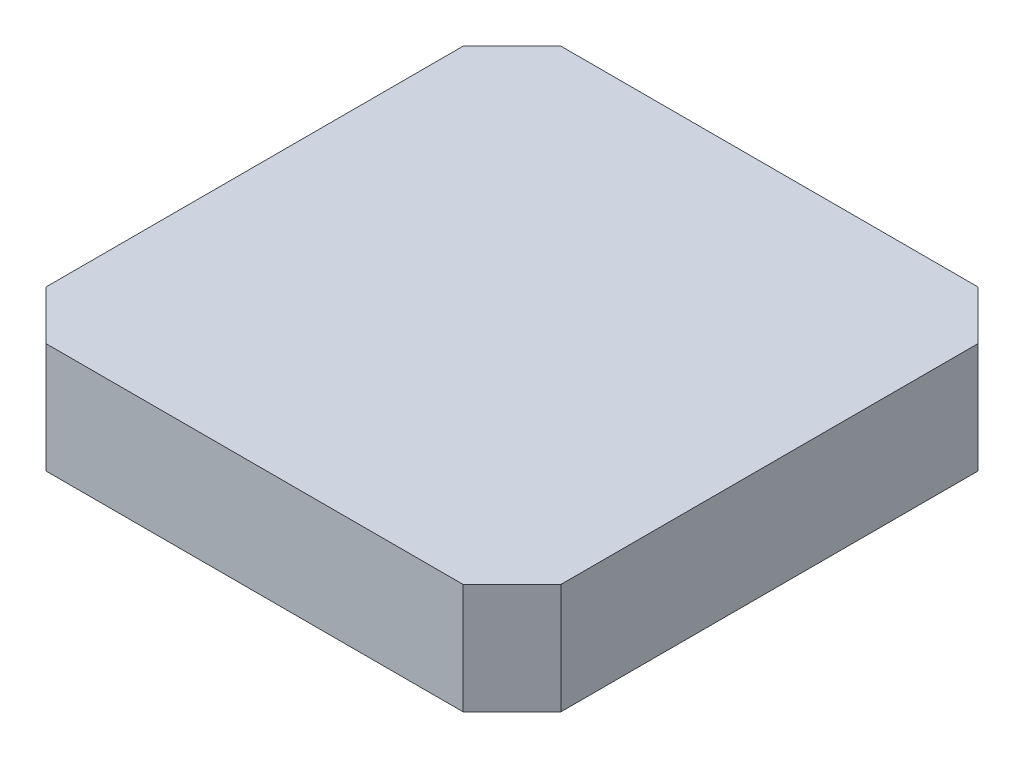
ISO-10303-21;
HEADER;
FILE_DESCRIPTION(('STEP AP214'),'2;1');
FILE_NAME('part.step','',(''),(''),'','','');
FILE_SCHEMA(('AUTOMOTIVE_DESIGN { 1 0 10303 214 1 1 1 1 }'));
ENDSEC;
DATA;
#1=APPLICATION_CONTEXT('core data for automotive mechanical design processes');
#2=APPLICATION_PROTOCOL_DEFINITION('international standard','automotive_design',2000,#1);
#3=PRODUCT_CONTEXT('',#1,'mechanical');
#4=PRODUCT('Part','Part','',(#3));
#5=PRODUCT_RELATED_PRODUCT_CATEGORY('part','',(#4));
#6=PRODUCT_DEFINITION_FORMATION('','',#4);
#7=PRODUCT_DEFINITION_CONTEXT('part definition',#1,'design');
#8=PRODUCT_DEFINITION('design','',#6,#7);
#9=PRODUCT_DEFINITION_SHAPE('','',#8);
#10=(LENGTH_UNIT() NAMED_UNIT(*) SI_UNIT(.MILLI.,.METRE.));
#11=(NAMED_UNIT(*) PLANE_ANGLE_UNIT() SI_UNIT($,.RADIAN.));
#12=(NAMED_UNIT(*) SI_UNIT($,.STERADIAN.) SOLID_ANGLE_UNIT());
#13=UNCERTAINTY_MEASURE_WITH_UNIT(LENGTH_MEASURE(1.E-05),#10,'distance_accuracy_value','');
#14=(GEOMETRIC_REPRESENTATION_CONTEXT(3) GLOBAL_UNCERTAINTY_ASSIGNED_CONTEXT((#13)) GLOBAL_UNIT_ASSIGNED_CONTEXT((#10,
#11,#12)) REPRESENTATION_CONTEXT('',''));
#15=CARTESIAN_POINT('',(0.,0.,0.));
#16=DIRECTION('',(0.,0.,1.));
#17=DIRECTION('',(1.,0.,0.));
#18=AXIS2_PLACEMENT_3D('',#15,#16,#17);
#19=CARTESIAN_POINT('',(-21.,9.,-21.));
#20=DIRECTION('',(1.,0.,0.));
#21=DIRECTION('',(0.,0.,-1.));
#22=AXIS2_PLACEMENT_3D('',#19,#20,#21);
#23=PLANE('',#22);
#24=DIRECTION('',(0.,0.,1.));
#25=VECTOR('',#24,1.);
#26=CARTESIAN_POINT('',(-21.,9.,-21.));
#27=LINE('',#26,#25);
#28=CARTESIAN_POINT('',(-21.,9.,-17.));
#29=VERTEX_POINT('',#28);
#30=CARTESIAN_POINT('',(-21.,9.,17.));
#31=VERTEX_POINT('',#30);
#32=EDGE_CURVE('E127',#29,#31,#27,.T.);
#33=ORIENTED_EDGE('',*,*,#32,.F.);
#34=DIRECTION('',(0.,-1.,0.));
#35=VECTOR('',#34,1.);
#36=CARTESIAN_POINT('',(-21.,9.,-17.));
#37=LINE('',#36,#35);
#38=CARTESIAN_POINT('',(-21.,0.,-17.));
#39=VERTEX_POINT('',#38);
#40=EDGE_CURVE('E11',#29,#39,#37,.T.);
#41=ORIENTED_EDGE('',*,*,#40,.T.);
#42=DIRECTION('',(0.,0.,1.));
#43=VECTOR('',#42,1.);
#44=CARTESIAN_POINT('',(-21.,0.,-21.));
#45=LINE('',#44,#43);
#46=CARTESIAN_POINT('',(-21.,0.,17.));
#47=VERTEX_POINT('',#46);
#48=EDGE_CURVE('E158',#39,#47,#45,.T.);
#49=ORIENTED_EDGE('',*,*,#48,.T.);
#50=DIRECTION('',(0.,1.,0.));
#51=VECTOR('',#50,1.);
#52=CARTESIAN_POINT('',(-21.,9.,17.));
#53=LINE('',#52,#51);
#54=EDGE_CURVE('E41',#47,#31,#53,.T.);
#55=ORIENTED_EDGE('',*,*,#54,.T.);
#56=EDGE_LOOP('',(#33,#41,#49,#55));
#57=FACE_BOUND('',#56,.T.);
#58=ADVANCED_FACE('F33',(#57),#23,.F.);
#59=CARTESIAN_POINT('',(-21.,9.,21.));
#60=DIRECTION('',(0.,0.,-1.));
#61=DIRECTION('',(-1.,0.,0.));
#62=AXIS2_PLACEMENT_3D('',#59,#60,#61);
#63=PLANE('',#62);
#64=DIRECTION('',(1.,0.,0.));
#65=VECTOR('',#64,1.);
#66=CARTESIAN_POINT('',(-21.,0.,21.));
#67=LINE('',#66,#65);
#68=CARTESIAN_POINT('',(-17.,0.,21.));
#69=VERTEX_POINT('',#68);
#70=CARTESIAN_POINT('',(17.,0.,21.));
#71=VERTEX_POINT('',#70);
#72=EDGE_CURVE('E132',#69,#71,#67,.T.);
#73=ORIENTED_EDGE('',*,*,#72,.T.);
#74=DIRECTION('',(0.,1.,0.));
#75=VECTOR('',#74,1.);
#76=CARTESIAN_POINT('',(17.,9.,21.));
#77=LINE('',#76,#75);
#78=CARTESIAN_POINT('',(17.,9.,21.));
#79=VERTEX_POINT('',#78);
#80=EDGE_CURVE('E48',#71,#79,#77,.T.);
#81=ORIENTED_EDGE('',*,*,#80,.T.);
#82=DIRECTION('',(1.,0.,0.));
#83=VECTOR('',#82,1.);
#84=CARTESIAN_POINT('',(-21.,9.,21.));
#85=LINE('',#84,#83);
#86=CARTESIAN_POINT('',(-17.,9.,21.));
#87=VERTEX_POINT('',#86);
#88=EDGE_CURVE('E130',#87,#79,#85,.T.);
#89=ORIENTED_EDGE('',*,*,#88,.F.);
#90=DIRECTION('',(0.,-1.,0.));
#91=VECTOR('',#90,1.);
#92=CARTESIAN_POINT('',(-17.,9.,21.));
#93=LINE('',#92,#91);
#94=EDGE_CURVE('E150',#87,#69,#93,.T.);
#95=ORIENTED_EDGE('',*,*,#94,.T.);
#96=EDGE_LOOP('',(#73,#81,#89,#95));
#97=FACE_BOUND('',#96,.T.);
#98=ADVANCED_FACE('F165',(#97),#63,.F.);
#99=CARTESIAN_POINT('',(21.,9.,-21.));
#100=DIRECTION('',(-1.,0.,0.));
#101=DIRECTION('',(0.,0.,1.));
#102=AXIS2_PLACEMENT_3D('',#99,#100,#101);
#103=PLANE('',#102);
#104=DIRECTION('',(0.,0.,-1.));
#105=VECTOR('',#104,1.);
#106=CARTESIAN_POINT('',(21.,0.,-21.));
#107=LINE('',#106,#105);
#108=CARTESIAN_POINT('',(21.,0.,17.));
#109=VERTEX_POINT('',#108);
#110=CARTESIAN_POINT('',(21.,0.,-17.));
#111=VERTEX_POINT('',#110);
#112=EDGE_CURVE('E128',#109,#111,#107,.T.);
#113=ORIENTED_EDGE('',*,*,#112,.T.);
#114=DIRECTION('',(0.,1.,0.));
#115=VECTOR('',#114,1.);
#116=CARTESIAN_POINT('',(21.,9.,-17.));
#117=LINE('',#116,#115);
#118=CARTESIAN_POINT('',(21.,9.,-17.));
#119=VERTEX_POINT('',#118);
#120=EDGE_CURVE('E105',#111,#119,#117,.T.);
#121=ORIENTED_EDGE('',*,*,#120,.T.);
#122=DIRECTION('',(0.,0.,-1.));
#123=VECTOR('',#122,1.);
#124=CARTESIAN_POINT('',(21.,9.,-21.));
#125=LINE('',#124,#123);
#126=CARTESIAN_POINT('',(21.,9.,17.));
#127=VERTEX_POINT('',#126);
#128=EDGE_CURVE('E170',#127,#119,#125,.T.);
#129=ORIENTED_EDGE('',*,*,#128,.F.);
#130=DIRECTION('',(0.,-1.,0.));
#131=VECTOR('',#130,1.);
#132=CARTESIAN_POINT('',(21.,9.,17.));
#133=LINE('',#132,#131);
#134=EDGE_CURVE('E110',#127,#109,#133,.T.);
#135=ORIENTED_EDGE('',*,*,#134,.T.);
#136=EDGE_LOOP('',(#113,#121,#129,#135));
#137=FACE_BOUND('',#136,.T.);
#138=ADVANCED_FACE('F196',(#137),#103,.F.);
#139=CARTESIAN_POINT('',(-21.,9.,-21.));
#140=DIRECTION('',(0.,0.,1.));
#141=DIRECTION('',(1.,0.,0.));
#142=AXIS2_PLACEMENT_3D('',#139,#140,#141);
#143=PLANE('',#142);
#144=DIRECTION('',(-1.,0.,0.));
#145=VECTOR('',#144,1.);
#146=CARTESIAN_POINT('',(-21.,9.,-21.));
#147=LINE('',#146,#145);
#148=CARTESIAN_POINT('',(17.,9.,-21.));
#149=VERTEX_POINT('',#148);
#150=CARTESIAN_POINT('',(-17.,9.,-21.));
#151=VERTEX_POINT('',#150);
#152=EDGE_CURVE('E120',#149,#151,#147,.T.);
#153=ORIENTED_EDGE('',*,*,#152,.F.);
#154=DIRECTION('',(0.,-1.,0.));
#155=VECTOR('',#154,1.);
#156=CARTESIAN_POINT('',(17.,9.,-21.));
#157=LINE('',#156,#155);
#158=CARTESIAN_POINT('',(17.,0.,-21.));
#159=VERTEX_POINT('',#158);
#160=EDGE_CURVE('E104',#149,#159,#157,.T.);
#161=ORIENTED_EDGE('',*,*,#160,.T.);
#162=DIRECTION('',(-1.,0.,0.));
#163=VECTOR('',#162,1.);
#164=CARTESIAN_POINT('',(-21.,0.,-21.));
#165=LINE('',#164,#163);
#166=CARTESIAN_POINT('',(-17.,0.,-21.));
#167=VERTEX_POINT('',#166);
#168=EDGE_CURVE('E117',#159,#167,#165,.T.);
#169=ORIENTED_EDGE('',*,*,#168,.T.);
#170=DIRECTION('',(0.,1.,0.));
#171=VECTOR('',#170,1.);
#172=CARTESIAN_POINT('',(-17.,9.,-21.));
#173=LINE('',#172,#171);
#174=EDGE_CURVE('E122',#167,#151,#173,.T.);
#175=ORIENTED_EDGE('',*,*,#174,.T.);
#176=EDGE_LOOP('',(#153,#161,#169,#175));
#177=FACE_BOUND('',#176,.T.);
#178=ADVANCED_FACE('F116',(#177),#143,.F.);
#179=CARTESIAN_POINT('',(-21.,9.,21.));
#180=DIRECTION('',(0.,1.,0.));
#181=DIRECTION('',(0.,0.,1.));
#182=AXIS2_PLACEMENT_3D('',#179,#180,#181);
#183=PLANE('',#182);
#184=ORIENTED_EDGE('',*,*,#128,.T.);
#185=DIRECTION('',(0.707106781186546,0.,0.707106781186549));
#186=VECTOR('',#185,1.);
#187=CARTESIAN_POINT('',(19.0000000000001,9.,-18.9999999999999));
#188=LINE('',#187,#186);
#189=EDGE_CURVE('E148',#119,#149,#188,.F.);
#190=ORIENTED_EDGE('',*,*,#189,.T.);
#191=ORIENTED_EDGE('',*,*,#152,.T.);
#192=DIRECTION('',(0.707106781186549,0.,-0.707106781186546));
#193=VECTOR('',#192,1.);
#194=CARTESIAN_POINT('',(-40.,9.,1.99999999999993));
#195=LINE('',#194,#193);
#196=EDGE_CURVE('E144',#151,#29,#195,.F.);
#197=ORIENTED_EDGE('',*,*,#196,.T.);
#198=ORIENTED_EDGE('',*,*,#32,.T.);
#199=DIRECTION('',(-0.707106781186546,0.,-0.707106781186549));
#200=VECTOR('',#199,1.);
#201=CARTESIAN_POINT('',(-19.,9.,19.));
#202=LINE('',#201,#200);
#203=EDGE_CURVE('E55',#31,#87,#202,.F.);
#204=ORIENTED_EDGE('',*,*,#203,.T.);
#205=ORIENTED_EDGE('',*,*,#88,.T.);
#206=DIRECTION('',(-0.707106781186549,0.,0.707106781186546));
#207=VECTOR('',#206,1.);
#208=CARTESIAN_POINT('',(-2.00000000000007,9.,40.));
#209=LINE('',#208,#207);
#210=EDGE_CURVE('E146',#79,#127,#209,.F.);
#211=ORIENTED_EDGE('',*,*,#210,.T.);
#212=EDGE_LOOP('',(#184,#190,#191,#197,#198,#204,#205,#211));
#213=FACE_BOUND('',#212,.T.);
#214=ADVANCED_FACE('F161',(#213),#183,.T.);
#215=CARTESIAN_POINT('',(-21.,0.,21.));
#216=DIRECTION('',(0.,1.,0.));
#217=DIRECTION('',(0.,0.,1.));
#218=AXIS2_PLACEMENT_3D('',#215,#216,#217);
#219=PLANE('',#218);
#220=CARTESIAN_POINT('',(0.,0.,0.));
#221=DIRECTION('',(0.,-1.,0.));
#222=DIRECTION('',(0.,0.,-1.));
#223=AXIS2_PLACEMENT_3D('',#220,#221,#222);
#224=CIRCLE('',#223,4.);
#225=CARTESIAN_POINT('',(0.,0.,-4.));
#226=VERTEX_POINT('',#225);
#227=EDGE_CURVE('E175',#226,#226,#224,.T.);
#228=ORIENTED_EDGE('',*,*,#227,.F.);
#229=EDGE_LOOP('',(#228));
#230=FACE_BOUND('',#229,.T.);
#231=ORIENTED_EDGE('',*,*,#168,.F.);
#232=DIRECTION('',(-0.707106781186546,0.,-0.707106781186549));
#233=VECTOR('',#232,1.);
#234=CARTESIAN_POINT('',(17.,0.,-21.));
#235=LINE('',#234,#233);
#236=EDGE_CURVE('E100',#159,#111,#235,.F.);
#237=ORIENTED_EDGE('',*,*,#236,.T.);
#238=ORIENTED_EDGE('',*,*,#112,.F.);
#239=DIRECTION('',(0.707106781186549,0.,-0.707106781186546));
#240=VECTOR('',#239,1.);
#241=CARTESIAN_POINT('',(21.,0.,17.));
#242=LINE('',#241,#240);
#243=EDGE_CURVE('E111',#109,#71,#242,.F.);
#244=ORIENTED_EDGE('',*,*,#243,.T.);
#245=ORIENTED_EDGE('',*,*,#72,.F.);
#246=DIRECTION('',(0.707106781186546,0.,0.707106781186549));
#247=VECTOR('',#246,1.);
#248=CARTESIAN_POINT('',(-17.,0.,21.));
#249=LINE('',#248,#247);
#250=EDGE_CURVE('E121',#69,#47,#249,.F.);
#251=ORIENTED_EDGE('',*,*,#250,.T.);
#252=ORIENTED_EDGE('',*,*,#48,.F.);
#253=DIRECTION('',(-0.707106781186549,0.,0.707106781186546));
#254=VECTOR('',#253,1.);
#255=CARTESIAN_POINT('',(-21.,0.,-17.));
#256=LINE('',#255,#254);
#257=EDGE_CURVE('E126',#39,#167,#256,.F.);
#258=ORIENTED_EDGE('',*,*,#257,.T.);
#259=EDGE_LOOP('',(#231,#237,#238,#244,#245,#251,#252,#258));
#260=FACE_BOUND('',#259,.T.);
#261=ADVANCED_FACE('F124',(#230,#260),#219,.F.);
#262=CARTESIAN_POINT('',(17.,9.,-21.));
#263=DIRECTION('',(-0.707106781186549,0.,0.707106781186546));
#264=DIRECTION('',(0.707106781186546,0.,0.707106781186549));
#265=AXIS2_PLACEMENT_3D('',#262,#263,#264);
#266=PLANE('',#265);
#267=ORIENTED_EDGE('',*,*,#189,.F.);
#268=ORIENTED_EDGE('',*,*,#120,.F.);
#269=ORIENTED_EDGE('',*,*,#236,.F.);
#270=ORIENTED_EDGE('',*,*,#160,.F.);
#271=EDGE_LOOP('',(#267,#268,#269,#270));
#272=FACE_BOUND('',#271,.T.);
#273=ADVANCED_FACE('F103',(#272),#266,.F.);
#274=CARTESIAN_POINT('',(21.,9.,17.));
#275=DIRECTION('',(-0.707106781186546,0.,-0.707106781186549));
#276=DIRECTION('',(-0.707106781186549,0.,0.707106781186546));
#277=AXIS2_PLACEMENT_3D('',#274,#275,#276);
#278=PLANE('',#277);
#279=ORIENTED_EDGE('',*,*,#210,.F.);
#280=ORIENTED_EDGE('',*,*,#80,.F.);
#281=ORIENTED_EDGE('',*,*,#243,.F.);
#282=ORIENTED_EDGE('',*,*,#134,.F.);
#283=EDGE_LOOP('',(#279,#280,#281,#282));
#284=FACE_BOUND('',#283,.T.);
#285=ADVANCED_FACE('F187',(#284),#278,.F.);
#286=CARTESIAN_POINT('',(-21.,9.,-17.));
#287=DIRECTION('',(0.707106781186546,0.,0.707106781186549));
#288=DIRECTION('',(0.707106781186549,0.,-0.707106781186546));
#289=AXIS2_PLACEMENT_3D('',#286,#287,#288);
#290=PLANE('',#289);
#291=ORIENTED_EDGE('',*,*,#196,.F.);
#292=ORIENTED_EDGE('',*,*,#174,.F.);
#293=ORIENTED_EDGE('',*,*,#257,.F.);
#294=ORIENTED_EDGE('',*,*,#40,.F.);
#295=EDGE_LOOP('',(#291,#292,#293,#294));
#296=FACE_BOUND('',#295,.T.);
#297=ADVANCED_FACE('F201',(#296),#290,.F.);
#298=CARTESIAN_POINT('',(-17.,9.,21.));
#299=DIRECTION('',(0.707106781186549,0.,-0.707106781186546));
#300=DIRECTION('',(-0.707106781186546,0.,-0.707106781186549));
#301=AXIS2_PLACEMENT_3D('',#298,#299,#300);
#302=PLANE('',#301);
#303=ORIENTED_EDGE('',*,*,#203,.F.);
#304=ORIENTED_EDGE('',*,*,#54,.F.);
#305=ORIENTED_EDGE('',*,*,#250,.F.);
#306=ORIENTED_EDGE('',*,*,#94,.F.);
#307=EDGE_LOOP('',(#303,#304,#305,#306));
#308=FACE_BOUND('',#307,.T.);
#309=ADVANCED_FACE('F35',(#308),#302,.F.);
#310=CARTESIAN_POINT('',(0.,0.,0.));
#311=DIRECTION('',(0.,1.,0.));
#312=DIRECTION('',(0.,0.,-1.));
#313=AXIS2_PLACEMENT_3D('',#310,#311,#312);
#314=CONICAL_SURFACE('',#313,4.,0.05235987755983);
#315=CARTESIAN_POINT('',(0.,3.,0.));
#316=DIRECTION('',(0.,-1.,0.));
#317=DIRECTION('',(0.,0.,-1.));
#318=AXIS2_PLACEMENT_3D('',#315,#316,#317);
#319=CIRCLE('',#318,4.15722333784912);
#320=CARTESIAN_POINT('',(0.,3.,-4.15722333784912));
#321=VERTEX_POINT('',#320);
#322=EDGE_CURVE('E166',#321,#321,#319,.T.);
#323=ORIENTED_EDGE('',*,*,#322,.F.);
#324=EDGE_LOOP('',(#323));
#325=FACE_BOUND('',#324,.T.);
#326=ORIENTED_EDGE('',*,*,#227,.T.);
#327=EDGE_LOOP('',(#326));
#328=FACE_BOUND('',#327,.T.);
#329=ADVANCED_FACE('F179',(#325,#328),#314,.F.);
#330=CARTESIAN_POINT('',(0.,3.,0.));
#331=DIRECTION('',(0.,-1.,0.));
#332=DIRECTION('',(0.,0.,-1.));
#333=AXIS2_PLACEMENT_3D('',#330,#331,#332);
#334=PLANE('',#333);
#335=ORIENTED_EDGE('',*,*,#322,.T.);
#336=EDGE_LOOP('',(#335));
#337=FACE_BOUND('',#336,.T.);
#338=ADVANCED_FACE('F257',(#337),#334,.T.);
#339=CLOSED_SHELL('',(#58,#98,#138,#178,#214,#261,#273,#285,#297,#309,#329,#338));
#340=MANIFOLD_SOLID_BREP('B2',#339);
#341=ADVANCED_BREP_SHAPE_REPRESENTATION('',(#18,#340),#14);
#342=SHAPE_DEFINITION_REPRESENTATION(#9,#341);
ENDSEC;
END-ISO-10303-21;
